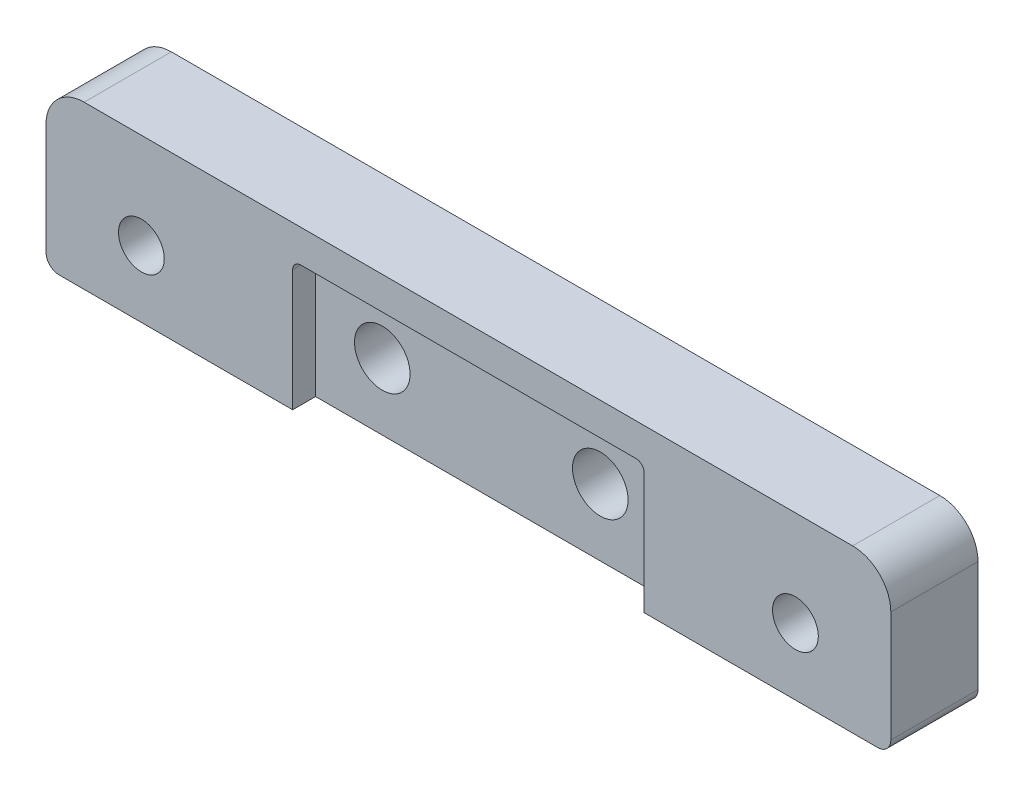
ISO-10303-21;
HEADER;
FILE_DESCRIPTION(('STEP AP214'),'2;1');
FILE_NAME('part.step','',(''),(''),'','','');
FILE_SCHEMA(('AUTOMOTIVE_DESIGN { 1 0 10303 214 1 1 1 1 }'));
ENDSEC;
DATA;
#1=APPLICATION_CONTEXT('core data for automotive mechanical design processes');
#2=APPLICATION_PROTOCOL_DEFINITION('international standard','automotive_design',2000,#1);
#3=PRODUCT_CONTEXT('',#1,'mechanical');
#4=PRODUCT('Part','Part','',(#3));
#5=PRODUCT_RELATED_PRODUCT_CATEGORY('part','',(#4));
#6=PRODUCT_DEFINITION_FORMATION('','',#4);
#7=PRODUCT_DEFINITION_CONTEXT('part definition',#1,'design');
#8=PRODUCT_DEFINITION('design','',#6,#7);
#9=PRODUCT_DEFINITION_SHAPE('','',#8);
#10=(LENGTH_UNIT() NAMED_UNIT(*) SI_UNIT(.MILLI.,.METRE.));
#11=(NAMED_UNIT(*) PLANE_ANGLE_UNIT() SI_UNIT($,.RADIAN.));
#12=(NAMED_UNIT(*) SI_UNIT($,.STERADIAN.) SOLID_ANGLE_UNIT());
#13=UNCERTAINTY_MEASURE_WITH_UNIT(LENGTH_MEASURE(1.E-05),#10,'distance_accuracy_value','');
#14=(GEOMETRIC_REPRESENTATION_CONTEXT(3) GLOBAL_UNCERTAINTY_ASSIGNED_CONTEXT((#13)) GLOBAL_UNIT_ASSIGNED_CONTEXT((#10,
#11,#12)) REPRESENTATION_CONTEXT('',''));
#15=CARTESIAN_POINT('',(0.,0.,0.));
#16=DIRECTION('',(0.,0.,1.));
#17=DIRECTION('',(1.,0.,0.));
#18=AXIS2_PLACEMENT_3D('',#15,#16,#17);
#19=CARTESIAN_POINT('',(-38.75,-7.437,8.));
#20=DIRECTION('',(1.,0.,0.));
#21=DIRECTION('',(0.,0.,-1.));
#22=AXIS2_PLACEMENT_3D('',#19,#20,#21);
#23=PLANE('',#22);
#24=DIRECTION('',(0.,-1.,0.));
#25=VECTOR('',#24,1.);
#26=CARTESIAN_POINT('',(-38.75,-7.437,0.));
#27=LINE('',#26,#25);
#28=CARTESIAN_POINT('',(-38.75,3.937,0.));
#29=VERTEX_POINT('',#28);
#30=CARTESIAN_POINT('',(-38.75,-6.237,0.));
#31=VERTEX_POINT('',#30);
#32=EDGE_CURVE('E179',#29,#31,#27,.T.);
#33=ORIENTED_EDGE('',*,*,#32,.T.);
#34=DIRECTION('',(0.,0.,-1.));
#35=VECTOR('',#34,1.);
#36=CARTESIAN_POINT('',(-38.75,-6.237,8.));
#37=LINE('',#36,#35);
#38=CARTESIAN_POINT('',(-38.75,-6.237,8.));
#39=VERTEX_POINT('',#38);
#40=EDGE_CURVE('E57',#31,#39,#37,.F.);
#41=ORIENTED_EDGE('',*,*,#40,.T.);
#42=DIRECTION('',(0.,-1.,0.));
#43=VECTOR('',#42,1.);
#44=CARTESIAN_POINT('',(-38.75,-7.437,8.));
#45=LINE('',#44,#43);
#46=CARTESIAN_POINT('',(-38.75,3.937,8.));
#47=VERTEX_POINT('',#46);
#48=EDGE_CURVE('E181',#47,#39,#45,.T.);
#49=ORIENTED_EDGE('',*,*,#48,.F.);
#50=DIRECTION('',(0.,0.,-1.));
#51=VECTOR('',#50,1.);
#52=CARTESIAN_POINT('',(-38.75,3.937,8.));
#53=LINE('',#52,#51);
#54=EDGE_CURVE('E217',#47,#29,#53,.T.);
#55=ORIENTED_EDGE('',*,*,#54,.T.);
#56=EDGE_LOOP('',(#33,#41,#49,#55));
#57=FACE_BOUND('',#56,.T.);
#58=ADVANCED_FACE('F34',(#57),#23,.F.);
#59=CARTESIAN_POINT('',(38.75,-7.437,8.));
#60=DIRECTION('',(0.,1.,0.));
#61=DIRECTION('',(-1.,0.,0.));
#62=AXIS2_PLACEMENT_3D('',#59,#60,#61);
#63=PLANE('',#62);
#64=DIRECTION('',(1.,0.,0.));
#65=VECTOR('',#64,1.);
#66=CARTESIAN_POINT('',(38.75,-7.437,8.));
#67=LINE('',#66,#65);
#68=CARTESIAN_POINT('',(-37.55,-7.437,8.));
#69=VERTEX_POINT('',#68);
#70=CARTESIAN_POINT('',(-16.12,-7.437,8.));
#71=VERTEX_POINT('',#70);
#72=EDGE_CURVE('E185',#69,#71,#67,.T.);
#73=ORIENTED_EDGE('',*,*,#72,.F.);
#74=DIRECTION('',(0.,0.,-1.));
#75=VECTOR('',#74,1.);
#76=CARTESIAN_POINT('',(-37.55,-7.437,8.));
#77=LINE('',#76,#75);
#78=CARTESIAN_POINT('',(-37.55,-7.437,0.));
#79=VERTEX_POINT('',#78);
#80=EDGE_CURVE('E238',#69,#79,#77,.T.);
#81=ORIENTED_EDGE('',*,*,#80,.T.);
#82=DIRECTION('',(1.,0.,0.));
#83=VECTOR('',#82,1.);
#84=CARTESIAN_POINT('',(38.75,-7.437,0.));
#85=LINE('',#84,#83);
#86=CARTESIAN_POINT('',(37.55,-7.437,0.));
#87=VERTEX_POINT('',#86);
#88=EDGE_CURVE('E194',#79,#87,#85,.T.);
#89=ORIENTED_EDGE('',*,*,#88,.T.);
#90=DIRECTION('',(0.,0.,-1.));
#91=VECTOR('',#90,1.);
#92=CARTESIAN_POINT('',(37.55,-7.437,8.));
#93=LINE('',#92,#91);
#94=CARTESIAN_POINT('',(37.55,-7.437,8.));
#95=VERTEX_POINT('',#94);
#96=EDGE_CURVE('E236',#87,#95,#93,.F.);
#97=ORIENTED_EDGE('',*,*,#96,.T.);
#98=CARTESIAN_POINT('',(16.12,-7.437,8.));
#99=VERTEX_POINT('',#98);
#100=EDGE_CURVE('E183',#99,#95,#67,.T.);
#101=ORIENTED_EDGE('',*,*,#100,.F.);
#102=DIRECTION('',(0.,0.,1.));
#103=VECTOR('',#102,1.);
#104=CARTESIAN_POINT('',(16.12,-7.437,5.9));
#105=LINE('',#104,#103);
#106=CARTESIAN_POINT('',(16.12,-7.437,5.9));
#107=VERTEX_POINT('',#106);
#108=EDGE_CURVE('E161',#107,#99,#105,.T.);
#109=ORIENTED_EDGE('',*,*,#108,.F.);
#110=DIRECTION('',(1.,0.,0.));
#111=VECTOR('',#110,1.);
#112=CARTESIAN_POINT('',(-16.12,-7.437,5.9));
#113=LINE('',#112,#111);
#114=CARTESIAN_POINT('',(-16.12,-7.437,5.9));
#115=VERTEX_POINT('',#114);
#116=EDGE_CURVE('E143',#115,#107,#113,.T.);
#117=ORIENTED_EDGE('',*,*,#116,.F.);
#118=DIRECTION('',(0.,0.,1.));
#119=VECTOR('',#118,1.);
#120=CARTESIAN_POINT('',(-16.12,-7.437,5.9));
#121=LINE('',#120,#119);
#122=EDGE_CURVE('E155',#115,#71,#121,.T.);
#123=ORIENTED_EDGE('',*,*,#122,.T.);
#124=EDGE_LOOP('',(#73,#81,#89,#97,#101,#109,#117,#123));
#125=FACE_BOUND('',#124,.T.);
#126=ADVANCED_FACE('F164',(#125),#63,.F.);
#127=CARTESIAN_POINT('',(38.75,-7.437,8.));
#128=DIRECTION('',(-1.,0.,0.));
#129=DIRECTION('',(0.,0.,1.));
#130=AXIS2_PLACEMENT_3D('',#127,#128,#129);
#131=PLANE('',#130);
#132=DIRECTION('',(0.,1.,0.));
#133=VECTOR('',#132,1.);
#134=CARTESIAN_POINT('',(38.75,-7.437,8.));
#135=LINE('',#134,#133);
#136=CARTESIAN_POINT('',(38.75,-6.237,8.));
#137=VERTEX_POINT('',#136);
#138=CARTESIAN_POINT('',(38.75,3.937,8.));
#139=VERTEX_POINT('',#138);
#140=EDGE_CURVE('E187',#137,#139,#135,.T.);
#141=ORIENTED_EDGE('',*,*,#140,.F.);
#142=DIRECTION('',(0.,0.,-1.));
#143=VECTOR('',#142,1.);
#144=CARTESIAN_POINT('',(38.75,-6.237,8.));
#145=LINE('',#144,#143);
#146=CARTESIAN_POINT('',(38.75,-6.237,0.));
#147=VERTEX_POINT('',#146);
#148=EDGE_CURVE('E11',#137,#147,#145,.T.);
#149=ORIENTED_EDGE('',*,*,#148,.T.);
#150=DIRECTION('',(0.,1.,0.));
#151=VECTOR('',#150,1.);
#152=CARTESIAN_POINT('',(38.75,-7.437,0.));
#153=LINE('',#152,#151);
#154=CARTESIAN_POINT('',(38.75,3.937,0.));
#155=VERTEX_POINT('',#154);
#156=EDGE_CURVE('E197',#147,#155,#153,.T.);
#157=ORIENTED_EDGE('',*,*,#156,.T.);
#158=DIRECTION('',(0.,0.,-1.));
#159=VECTOR('',#158,1.);
#160=CARTESIAN_POINT('',(38.75,3.937,8.));
#161=LINE('',#160,#159);
#162=EDGE_CURVE('E210',#155,#139,#161,.F.);
#163=ORIENTED_EDGE('',*,*,#162,.T.);
#164=EDGE_LOOP('',(#141,#149,#157,#163));
#165=FACE_BOUND('',#164,.T.);
#166=ADVANCED_FACE('F271',(#165),#131,.F.);
#167=CARTESIAN_POINT('',(38.75,7.437,8.));
#168=DIRECTION('',(0.,-1.,0.));
#169=DIRECTION('',(1.,0.,0.));
#170=AXIS2_PLACEMENT_3D('',#167,#168,#169);
#171=PLANE('',#170);
#172=DIRECTION('',(-1.,0.,0.));
#173=VECTOR('',#172,1.);
#174=CARTESIAN_POINT('',(38.75,7.437,8.));
#175=LINE('',#174,#173);
#176=CARTESIAN_POINT('',(35.25,7.437,8.));
#177=VERTEX_POINT('',#176);
#178=CARTESIAN_POINT('',(-35.25,7.437,8.));
#179=VERTEX_POINT('',#178);
#180=EDGE_CURVE('E189',#177,#179,#175,.T.);
#181=ORIENTED_EDGE('',*,*,#180,.F.);
#182=DIRECTION('',(0.,0.,-1.));
#183=VECTOR('',#182,1.);
#184=CARTESIAN_POINT('',(35.25,7.437,8.));
#185=LINE('',#184,#183);
#186=CARTESIAN_POINT('',(35.25,7.437,0.));
#187=VERTEX_POINT('',#186);
#188=EDGE_CURVE('E202',#177,#187,#185,.T.);
#189=ORIENTED_EDGE('',*,*,#188,.T.);
#190=DIRECTION('',(-1.,0.,0.));
#191=VECTOR('',#190,1.);
#192=CARTESIAN_POINT('',(38.75,7.437,0.));
#193=LINE('',#192,#191);
#194=CARTESIAN_POINT('',(-35.25,7.437,0.));
#195=VERTEX_POINT('',#194);
#196=EDGE_CURVE('E184',#187,#195,#193,.T.);
#197=ORIENTED_EDGE('',*,*,#196,.T.);
#198=DIRECTION('',(0.,0.,-1.));
#199=VECTOR('',#198,1.);
#200=CARTESIAN_POINT('',(-35.25,7.437,8.));
#201=LINE('',#200,#199);
#202=EDGE_CURVE('E192',#195,#179,#201,.F.);
#203=ORIENTED_EDGE('',*,*,#202,.T.);
#204=EDGE_LOOP('',(#181,#189,#197,#203));
#205=FACE_BOUND('',#204,.T.);
#206=ADVANCED_FACE('F263',(#205),#171,.F.);
#207=CARTESIAN_POINT('',(0.,0.,8.));
#208=DIRECTION('',(0.,0.,1.));
#209=DIRECTION('',(1.,0.,0.));
#210=AXIS2_PLACEMENT_3D('',#207,#208,#209);
#211=PLANE('',#210);
#212=CARTESIAN_POINT('',(-30.,-1.323,8.));
#213=DIRECTION('',(0.,0.,1.));
#214=DIRECTION('',(1.,0.,0.));
#215=AXIS2_PLACEMENT_3D('',#212,#213,#214);
#216=CIRCLE('',#215,2.09999999999999);
#217=CARTESIAN_POINT('',(-27.9,-1.323,8.));
#218=VERTEX_POINT('',#217);
#219=EDGE_CURVE('E486',#218,#218,#216,.T.);
#220=ORIENTED_EDGE('',*,*,#219,.F.);
#221=EDGE_LOOP('',(#220));
#222=FACE_BOUND('',#221,.T.);
#223=CARTESIAN_POINT('',(30.,-1.323,8.));
#224=DIRECTION('',(0.,0.,1.));
#225=DIRECTION('',(1.,0.,0.));
#226=AXIS2_PLACEMENT_3D('',#223,#224,#225);
#227=CIRCLE('',#226,2.09999999999999);
#228=CARTESIAN_POINT('',(32.1,-1.323,8.));
#229=VERTEX_POINT('',#228);
#230=EDGE_CURVE('E482',#229,#229,#227,.T.);
#231=ORIENTED_EDGE('',*,*,#230,.F.);
#232=EDGE_LOOP('',(#231));
#233=FACE_BOUND('',#232,.T.);
#234=ORIENTED_EDGE('',*,*,#48,.T.);
#235=CARTESIAN_POINT('',(-37.55,-6.237,8.));
#236=DIRECTION('',(0.,0.,1.));
#237=DIRECTION('',(1.,0.,0.));
#238=AXIS2_PLACEMENT_3D('',#235,#236,#237);
#239=CIRCLE('',#238,1.2);
#240=EDGE_CURVE('E42',#39,#69,#239,.T.);
#241=ORIENTED_EDGE('',*,*,#240,.T.);
#242=ORIENTED_EDGE('',*,*,#72,.T.);
#243=DIRECTION('',(0.,-1.,0.));
#244=VECTOR('',#243,1.);
#245=CARTESIAN_POINT('',(-16.12,-7.437,8.));
#246=LINE('',#245,#244);
#247=CARTESIAN_POINT('',(-16.12,3.69,8.));
#248=VERTEX_POINT('',#247);
#249=EDGE_CURVE('E158',#248,#71,#246,.T.);
#250=ORIENTED_EDGE('',*,*,#249,.F.);
#251=CARTESIAN_POINT('',(-15.37,3.69,8.));
#252=DIRECTION('',(0.,0.,1.));
#253=DIRECTION('',(1.,0.,0.));
#254=AXIS2_PLACEMENT_3D('',#251,#252,#253);
#255=CIRCLE('',#254,0.75);
#256=CARTESIAN_POINT('',(-15.37,4.44,8.));
#257=VERTEX_POINT('',#256);
#258=EDGE_CURVE('E234',#248,#257,#255,.F.);
#259=ORIENTED_EDGE('',*,*,#258,.T.);
#260=DIRECTION('',(-1.,0.,0.));
#261=VECTOR('',#260,1.);
#262=CARTESIAN_POINT('',(-16.12,4.44,8.));
#263=LINE('',#262,#261);
#264=CARTESIAN_POINT('',(15.37,4.44,8.));
#265=VERTEX_POINT('',#264);
#266=EDGE_CURVE('E151',#265,#257,#263,.T.);
#267=ORIENTED_EDGE('',*,*,#266,.F.);
#268=CARTESIAN_POINT('',(15.37,3.69,8.));
#269=DIRECTION('',(0.,0.,1.));
#270=DIRECTION('',(1.,0.,0.));
#271=AXIS2_PLACEMENT_3D('',#268,#269,#270);
#272=CIRCLE('',#271,0.75);
#273=CARTESIAN_POINT('',(16.12,3.69,8.));
#274=VERTEX_POINT('',#273);
#275=EDGE_CURVE('E232',#265,#274,#272,.F.);
#276=ORIENTED_EDGE('',*,*,#275,.T.);
#277=DIRECTION('',(0.,1.,0.));
#278=VECTOR('',#277,1.);
#279=CARTESIAN_POINT('',(16.12,-7.437,8.));
#280=LINE('',#279,#278);
#281=EDGE_CURVE('E173',#99,#274,#280,.T.);
#282=ORIENTED_EDGE('',*,*,#281,.F.);
#283=ORIENTED_EDGE('',*,*,#100,.T.);
#284=CARTESIAN_POINT('',(37.55,-6.237,8.));
#285=DIRECTION('',(0.,0.,1.));
#286=DIRECTION('',(1.,0.,0.));
#287=AXIS2_PLACEMENT_3D('',#284,#285,#286);
#288=CIRCLE('',#287,1.2);
#289=EDGE_CURVE('E49',#95,#137,#288,.T.);
#290=ORIENTED_EDGE('',*,*,#289,.T.);
#291=ORIENTED_EDGE('',*,*,#140,.T.);
#292=CARTESIAN_POINT('',(35.25,3.937,8.));
#293=DIRECTION('',(0.,0.,1.));
#294=DIRECTION('',(1.,0.,0.));
#295=AXIS2_PLACEMENT_3D('',#292,#293,#294);
#296=CIRCLE('',#295,3.5);
#297=EDGE_CURVE('E215',#139,#177,#296,.T.);
#298=ORIENTED_EDGE('',*,*,#297,.T.);
#299=ORIENTED_EDGE('',*,*,#180,.T.);
#300=CARTESIAN_POINT('',(-35.25,3.937,8.));
#301=DIRECTION('',(0.,0.,1.));
#302=DIRECTION('',(1.,0.,0.));
#303=AXIS2_PLACEMENT_3D('',#300,#301,#302);
#304=CIRCLE('',#303,3.5);
#305=EDGE_CURVE('E213',#179,#47,#304,.T.);
#306=ORIENTED_EDGE('',*,*,#305,.T.);
#307=EDGE_LOOP('',(#234,#241,#242,#250,#259,#267,#276,#282,#283,#290,#291,#298,#299,#306));
#308=FACE_BOUND('',#307,.T.);
#309=ADVANCED_FACE('F247',(#222,#233,#308),#211,.T.);
#310=CARTESIAN_POINT('',(0.,0.,0.));
#311=DIRECTION('',(0.,0.,1.));
#312=DIRECTION('',(1.,0.,0.));
#313=AXIS2_PLACEMENT_3D('',#310,#311,#312);
#314=PLANE('',#313);
#315=CARTESIAN_POINT('',(-30.,-1.323,0.));
#316=DIRECTION('',(0.,0.,1.));
#317=DIRECTION('',(1.,0.,0.));
#318=AXIS2_PLACEMENT_3D('',#315,#316,#317);
#319=CIRCLE('',#318,2.1);
#320=CARTESIAN_POINT('',(-27.9,-1.323,0.));
#321=VERTEX_POINT('',#320);
#322=EDGE_CURVE('E462',#321,#321,#319,.T.);
#323=ORIENTED_EDGE('',*,*,#322,.T.);
#324=EDGE_LOOP('',(#323));
#325=FACE_BOUND('',#324,.T.);
#326=CARTESIAN_POINT('',(30.,-1.323,0.));
#327=DIRECTION('',(0.,0.,1.));
#328=DIRECTION('',(1.,0.,0.));
#329=AXIS2_PLACEMENT_3D('',#326,#327,#328);
#330=CIRCLE('',#329,2.1);
#331=CARTESIAN_POINT('',(32.1,-1.323,0.));
#332=VERTEX_POINT('',#331);
#333=EDGE_CURVE('E466',#332,#332,#330,.T.);
#334=ORIENTED_EDGE('',*,*,#333,.T.);
#335=EDGE_LOOP('',(#334));
#336=FACE_BOUND('',#335,.T.);
#337=CARTESIAN_POINT('',(10.,-1.32299999999999,0.));
#338=DIRECTION('',(0.,0.,1.));
#339=DIRECTION('',(-1.,0.,0.));
#340=AXIS2_PLACEMENT_3D('',#337,#338,#339);
#341=CIRCLE('',#340,2.55);
#342=CARTESIAN_POINT('',(7.45,-1.32299999999999,0.));
#343=VERTEX_POINT('',#342);
#344=EDGE_CURVE('E470',#343,#343,#341,.T.);
#345=ORIENTED_EDGE('',*,*,#344,.T.);
#346=EDGE_LOOP('',(#345));
#347=FACE_BOUND('',#346,.T.);
#348=CARTESIAN_POINT('',(-10.,-1.323,0.));
#349=DIRECTION('',(0.,0.,1.));
#350=DIRECTION('',(1.,0.,0.));
#351=AXIS2_PLACEMENT_3D('',#348,#349,#350);
#352=CIRCLE('',#351,2.55);
#353=CARTESIAN_POINT('',(-7.45,-1.323,0.));
#354=VERTEX_POINT('',#353);
#355=EDGE_CURVE('E174',#354,#354,#352,.T.);
#356=ORIENTED_EDGE('',*,*,#355,.T.);
#357=EDGE_LOOP('',(#356));
#358=FACE_BOUND('',#357,.T.);
#359=ORIENTED_EDGE('',*,*,#88,.F.);
#360=CARTESIAN_POINT('',(-37.55,-6.237,0.));
#361=DIRECTION('',(0.,0.,1.));
#362=DIRECTION('',(1.,0.,0.));
#363=AXIS2_PLACEMENT_3D('',#360,#361,#362);
#364=CIRCLE('',#363,1.2);
#365=EDGE_CURVE('E243',#79,#31,#364,.F.);
#366=ORIENTED_EDGE('',*,*,#365,.T.);
#367=ORIENTED_EDGE('',*,*,#32,.F.);
#368=CARTESIAN_POINT('',(-35.25,3.937,0.));
#369=DIRECTION('',(0.,0.,1.));
#370=DIRECTION('',(1.,0.,0.));
#371=AXIS2_PLACEMENT_3D('',#368,#369,#370);
#372=CIRCLE('',#371,3.5);
#373=EDGE_CURVE('E205',#29,#195,#372,.F.);
#374=ORIENTED_EDGE('',*,*,#373,.T.);
#375=ORIENTED_EDGE('',*,*,#196,.F.);
#376=CARTESIAN_POINT('',(35.25,3.937,0.));
#377=DIRECTION('',(0.,0.,1.));
#378=DIRECTION('',(1.,0.,0.));
#379=AXIS2_PLACEMENT_3D('',#376,#377,#378);
#380=CIRCLE('',#379,3.5);
#381=EDGE_CURVE('E207',#187,#155,#380,.F.);
#382=ORIENTED_EDGE('',*,*,#381,.T.);
#383=ORIENTED_EDGE('',*,*,#156,.F.);
#384=CARTESIAN_POINT('',(37.55,-6.237,0.));
#385=DIRECTION('',(0.,0.,1.));
#386=DIRECTION('',(1.,0.,0.));
#387=AXIS2_PLACEMENT_3D('',#384,#385,#386);
#388=CIRCLE('',#387,1.2);
#389=EDGE_CURVE('E241',#147,#87,#388,.F.);
#390=ORIENTED_EDGE('',*,*,#389,.T.);
#391=EDGE_LOOP('',(#359,#366,#367,#374,#375,#382,#383,#390));
#392=FACE_BOUND('',#391,.T.);
#393=ADVANCED_FACE('F254',(#325,#336,#347,#358,#392),#314,.F.);
#394=CARTESIAN_POINT('',(-16.12,-7.437,5.9));
#395=DIRECTION('',(-1.,0.,0.));
#396=DIRECTION('',(0.,0.,1.));
#397=AXIS2_PLACEMENT_3D('',#394,#395,#396);
#398=PLANE('',#397);
#399=DIRECTION('',(0.,-1.,0.));
#400=VECTOR('',#399,1.);
#401=CARTESIAN_POINT('',(-16.12,-7.437,5.9));
#402=LINE('',#401,#400);
#403=CARTESIAN_POINT('',(-16.12,3.69,5.9));
#404=VERTEX_POINT('',#403);
#405=EDGE_CURVE('E138',#404,#115,#402,.T.);
#406=ORIENTED_EDGE('',*,*,#405,.F.);
#407=DIRECTION('',(0.,0.,1.));
#408=VECTOR('',#407,1.);
#409=CARTESIAN_POINT('',(-16.12,3.69,8.));
#410=LINE('',#409,#408);
#411=EDGE_CURVE('E230',#404,#248,#410,.T.);
#412=ORIENTED_EDGE('',*,*,#411,.T.);
#413=ORIENTED_EDGE('',*,*,#249,.T.);
#414=ORIENTED_EDGE('',*,*,#122,.F.);
#415=EDGE_LOOP('',(#406,#412,#413,#414));
#416=FACE_BOUND('',#415,.T.);
#417=ADVANCED_FACE('F156',(#416),#398,.F.);
#418=CARTESIAN_POINT('',(-16.12,4.44,5.9));
#419=DIRECTION('',(0.,1.,0.));
#420=DIRECTION('',(0.,0.,1.));
#421=AXIS2_PLACEMENT_3D('',#418,#419,#420);
#422=PLANE('',#421);
#423=DIRECTION('',(-1.,0.,0.));
#424=VECTOR('',#423,1.);
#425=CARTESIAN_POINT('',(-16.12,4.44,5.9));
#426=LINE('',#425,#424);
#427=CARTESIAN_POINT('',(15.37,4.44,5.9));
#428=VERTEX_POINT('',#427);
#429=CARTESIAN_POINT('',(-15.37,4.44,5.9));
#430=VERTEX_POINT('',#429);
#431=EDGE_CURVE('E162',#428,#430,#426,.T.);
#432=ORIENTED_EDGE('',*,*,#431,.F.);
#433=DIRECTION('',(0.,0.,1.));
#434=VECTOR('',#433,1.);
#435=CARTESIAN_POINT('',(15.37,4.44,8.));
#436=LINE('',#435,#434);
#437=EDGE_CURVE('E222',#428,#265,#436,.T.);
#438=ORIENTED_EDGE('',*,*,#437,.T.);
#439=ORIENTED_EDGE('',*,*,#266,.T.);
#440=DIRECTION('',(0.,0.,1.));
#441=VECTOR('',#440,1.);
#442=CARTESIAN_POINT('',(-15.37,4.44,5.9));
#443=LINE('',#442,#441);
#444=EDGE_CURVE('E220',#257,#430,#443,.F.);
#445=ORIENTED_EDGE('',*,*,#444,.T.);
#446=EDGE_LOOP('',(#432,#438,#439,#445));
#447=FACE_BOUND('',#446,.T.);
#448=ADVANCED_FACE('F286',(#447),#422,.F.);
#449=CARTESIAN_POINT('',(16.12,-7.437,5.9));
#450=DIRECTION('',(1.,0.,0.));
#451=DIRECTION('',(0.,0.,-1.));
#452=AXIS2_PLACEMENT_3D('',#449,#450,#451);
#453=PLANE('',#452);
#454=ORIENTED_EDGE('',*,*,#281,.T.);
#455=DIRECTION('',(0.,0.,1.));
#456=VECTOR('',#455,1.);
#457=CARTESIAN_POINT('',(16.12,3.69,5.9));
#458=LINE('',#457,#456);
#459=CARTESIAN_POINT('',(16.12,3.69,5.9));
#460=VERTEX_POINT('',#459);
#461=EDGE_CURVE('E225',#274,#460,#458,.F.);
#462=ORIENTED_EDGE('',*,*,#461,.T.);
#463=DIRECTION('',(0.,1.,0.));
#464=VECTOR('',#463,1.);
#465=CARTESIAN_POINT('',(16.12,-7.437,5.9));
#466=LINE('',#465,#464);
#467=EDGE_CURVE('E166',#107,#460,#466,.T.);
#468=ORIENTED_EDGE('',*,*,#467,.F.);
#469=ORIENTED_EDGE('',*,*,#108,.T.);
#470=EDGE_LOOP('',(#454,#462,#468,#469));
#471=FACE_BOUND('',#470,.T.);
#472=ADVANCED_FACE('F279',(#471),#453,.F.);
#473=CARTESIAN_POINT('',(0.,0.,5.9));
#474=DIRECTION('',(0.,0.,-1.));
#475=DIRECTION('',(-1.,0.,0.));
#476=AXIS2_PLACEMENT_3D('',#473,#474,#475);
#477=PLANE('',#476);
#478=CARTESIAN_POINT('',(10.,-1.32299999999999,5.9));
#479=DIRECTION('',(0.,0.,1.));
#480=DIRECTION('',(-1.,0.,0.));
#481=AXIS2_PLACEMENT_3D('',#478,#479,#480);
#482=CIRCLE('',#481,2.55);
#483=CARTESIAN_POINT('',(7.45,-1.32299999999999,5.9));
#484=VERTEX_POINT('',#483);
#485=EDGE_CURVE('E477',#484,#484,#482,.T.);
#486=ORIENTED_EDGE('',*,*,#485,.F.);
#487=EDGE_LOOP('',(#486));
#488=FACE_BOUND('',#487,.T.);
#489=CARTESIAN_POINT('',(-10.,-1.323,5.9));
#490=DIRECTION('',(0.,0.,1.));
#491=DIRECTION('',(1.,0.,0.));
#492=AXIS2_PLACEMENT_3D('',#489,#490,#491);
#493=CIRCLE('',#492,2.55);
#494=CARTESIAN_POINT('',(-7.45,-1.323,5.9));
#495=VERTEX_POINT('',#494);
#496=EDGE_CURVE('E473',#495,#495,#493,.T.);
#497=ORIENTED_EDGE('',*,*,#496,.F.);
#498=EDGE_LOOP('',(#497));
#499=FACE_BOUND('',#498,.T.);
#500=ORIENTED_EDGE('',*,*,#467,.T.);
#501=CARTESIAN_POINT('',(15.37,3.69,5.9));
#502=DIRECTION('',(0.,0.,-1.));
#503=DIRECTION('',(-1.,0.,0.));
#504=AXIS2_PLACEMENT_3D('',#501,#502,#503);
#505=CIRCLE('',#504,0.75);
#506=EDGE_CURVE('E228',#460,#428,#505,.F.);
#507=ORIENTED_EDGE('',*,*,#506,.T.);
#508=ORIENTED_EDGE('',*,*,#431,.T.);
#509=CARTESIAN_POINT('',(-15.37,3.69,5.9));
#510=DIRECTION('',(0.,0.,-1.));
#511=DIRECTION('',(-1.,0.,0.));
#512=AXIS2_PLACEMENT_3D('',#509,#510,#511);
#513=CIRCLE('',#512,0.75);
#514=EDGE_CURVE('E147',#430,#404,#513,.F.);
#515=ORIENTED_EDGE('',*,*,#514,.T.);
#516=ORIENTED_EDGE('',*,*,#405,.T.);
#517=ORIENTED_EDGE('',*,*,#116,.T.);
#518=EDGE_LOOP('',(#500,#507,#508,#515,#516,#517));
#519=FACE_BOUND('',#518,.T.);
#520=ADVANCED_FACE('F141',(#488,#499,#519),#477,.F.);
#521=CARTESIAN_POINT('',(35.25,3.937,8.));
#522=DIRECTION('',(0.,0.,-1.));
#523=DIRECTION('',(-1.,0.,0.));
#524=AXIS2_PLACEMENT_3D('',#521,#522,#523);
#525=CYLINDRICAL_SURFACE('',#524,3.5);
#526=ORIENTED_EDGE('',*,*,#297,.F.);
#527=ORIENTED_EDGE('',*,*,#162,.F.);
#528=ORIENTED_EDGE('',*,*,#381,.F.);
#529=ORIENTED_EDGE('',*,*,#188,.F.);
#530=EDGE_LOOP('',(#526,#527,#528,#529));
#531=FACE_BOUND('',#530,.T.);
#532=ADVANCED_FACE('F267',(#531),#525,.T.);
#533=CARTESIAN_POINT('',(-35.25,3.937,8.));
#534=DIRECTION('',(0.,0.,-1.));
#535=DIRECTION('',(-1.,0.,0.));
#536=AXIS2_PLACEMENT_3D('',#533,#534,#535);
#537=CYLINDRICAL_SURFACE('',#536,3.5);
#538=ORIENTED_EDGE('',*,*,#305,.F.);
#539=ORIENTED_EDGE('',*,*,#202,.F.);
#540=ORIENTED_EDGE('',*,*,#373,.F.);
#541=ORIENTED_EDGE('',*,*,#54,.F.);
#542=EDGE_LOOP('',(#538,#539,#540,#541));
#543=FACE_BOUND('',#542,.T.);
#544=ADVANCED_FACE('F258',(#543),#537,.T.);
#545=CARTESIAN_POINT('',(15.37,3.69,5.9));
#546=DIRECTION('',(0.,0.,-1.));
#547=DIRECTION('',(-1.,0.,0.));
#548=AXIS2_PLACEMENT_3D('',#545,#546,#547);
#549=CYLINDRICAL_SURFACE('',#548,0.75);
#550=ORIENTED_EDGE('',*,*,#506,.F.);
#551=ORIENTED_EDGE('',*,*,#461,.F.);
#552=ORIENTED_EDGE('',*,*,#275,.F.);
#553=ORIENTED_EDGE('',*,*,#437,.F.);
#554=EDGE_LOOP('',(#550,#551,#552,#553));
#555=FACE_BOUND('',#554,.T.);
#556=ADVANCED_FACE('F282',(#555),#549,.F.);
#557=CARTESIAN_POINT('',(-15.37,3.69,5.9));
#558=DIRECTION('',(0.,0.,-1.));
#559=DIRECTION('',(-1.,0.,0.));
#560=AXIS2_PLACEMENT_3D('',#557,#558,#559);
#561=CYLINDRICAL_SURFACE('',#560,0.75);
#562=ORIENTED_EDGE('',*,*,#514,.F.);
#563=ORIENTED_EDGE('',*,*,#444,.F.);
#564=ORIENTED_EDGE('',*,*,#258,.F.);
#565=ORIENTED_EDGE('',*,*,#411,.F.);
#566=EDGE_LOOP('',(#562,#563,#564,#565));
#567=FACE_BOUND('',#566,.T.);
#568=ADVANCED_FACE('F289',(#567),#561,.F.);
#569=CARTESIAN_POINT('',(-10.,-1.323,0.));
#570=DIRECTION('',(0.,0.,1.));
#571=DIRECTION('',(1.,0.,0.));
#572=AXIS2_PLACEMENT_3D('',#569,#570,#571);
#573=CYLINDRICAL_SURFACE('',#572,2.55);
#574=ORIENTED_EDGE('',*,*,#355,.F.);
#575=EDGE_LOOP('',(#574));
#576=FACE_BOUND('',#575,.T.);
#577=ORIENTED_EDGE('',*,*,#496,.T.);
#578=EDGE_LOOP('',(#577));
#579=FACE_BOUND('',#578,.T.);
#580=ADVANCED_FACE('F291',(#576,#579),#573,.F.);
#581=CARTESIAN_POINT('',(10.,-1.32299999999999,0.));
#582=DIRECTION('',(0.,0.,1.));
#583=DIRECTION('',(1.,0.,0.));
#584=AXIS2_PLACEMENT_3D('',#581,#582,#583);
#585=CYLINDRICAL_SURFACE('',#584,2.55);
#586=ORIENTED_EDGE('',*,*,#344,.F.);
#587=EDGE_LOOP('',(#586));
#588=FACE_BOUND('',#587,.T.);
#589=ORIENTED_EDGE('',*,*,#485,.T.);
#590=EDGE_LOOP('',(#589));
#591=FACE_BOUND('',#590,.T.);
#592=ADVANCED_FACE('F297',(#588,#591),#585,.F.);
#593=CARTESIAN_POINT('',(30.,-1.323,8.));
#594=DIRECTION('',(0.,0.,1.));
#595=DIRECTION('',(1.,0.,0.));
#596=AXIS2_PLACEMENT_3D('',#593,#594,#595);
#597=CYLINDRICAL_SURFACE('',#596,2.09999999999999);
#598=ORIENTED_EDGE('',*,*,#333,.F.);
#599=EDGE_LOOP('',(#598));
#600=FACE_BOUND('',#599,.T.);
#601=ORIENTED_EDGE('',*,*,#230,.T.);
#602=EDGE_LOOP('',(#601));
#603=FACE_BOUND('',#602,.T.);
#604=ADVANCED_FACE('F355',(#600,#603),#597,.F.);
#605=CARTESIAN_POINT('',(-30.,-1.323,8.));
#606=DIRECTION('',(0.,0.,1.));
#607=DIRECTION('',(1.,0.,0.));
#608=AXIS2_PLACEMENT_3D('',#605,#606,#607);
#609=CYLINDRICAL_SURFACE('',#608,2.09999999999999);
#610=ORIENTED_EDGE('',*,*,#322,.F.);
#611=EDGE_LOOP('',(#610));
#612=FACE_BOUND('',#611,.T.);
#613=ORIENTED_EDGE('',*,*,#219,.T.);
#614=EDGE_LOOP('',(#613));
#615=FACE_BOUND('',#614,.T.);
#616=ADVANCED_FACE('F365',(#612,#615),#609,.F.);
#617=CARTESIAN_POINT('',(-37.55,-6.237,8.));
#618=DIRECTION('',(0.,0.,-1.));
#619=DIRECTION('',(-1.,0.,0.));
#620=AXIS2_PLACEMENT_3D('',#617,#618,#619);
#621=CYLINDRICAL_SURFACE('',#620,1.2);
#622=ORIENTED_EDGE('',*,*,#240,.F.);
#623=ORIENTED_EDGE('',*,*,#40,.F.);
#624=ORIENTED_EDGE('',*,*,#365,.F.);
#625=ORIENTED_EDGE('',*,*,#80,.F.);
#626=EDGE_LOOP('',(#622,#623,#624,#625));
#627=FACE_BOUND('',#626,.T.);
#628=ADVANCED_FACE('F251',(#627),#621,.T.);
#629=CARTESIAN_POINT('',(37.55,-6.237,8.));
#630=DIRECTION('',(0.,0.,-1.));
#631=DIRECTION('',(-1.,0.,0.));
#632=AXIS2_PLACEMENT_3D('',#629,#630,#631);
#633=CYLINDRICAL_SURFACE('',#632,1.2);
#634=ORIENTED_EDGE('',*,*,#289,.F.);
#635=ORIENTED_EDGE('',*,*,#96,.F.);
#636=ORIENTED_EDGE('',*,*,#389,.F.);
#637=ORIENTED_EDGE('',*,*,#148,.F.);
#638=EDGE_LOOP('',(#634,#635,#636,#637));
#639=FACE_BOUND('',#638,.T.);
#640=ADVANCED_FACE('F36',(#639),#633,.T.);
#641=CLOSED_SHELL('',(#58,#126,#166,#206,#309,#393,#417,#448,#472,#520,#532,#544,#556,#568,#580,
#592,#604,#616,#628,#640));
#642=MANIFOLD_SOLID_BREP('B2',#641);
#643=ADVANCED_BREP_SHAPE_REPRESENTATION('',(#18,#642),#14);
#644=SHAPE_DEFINITION_REPRESENTATION(#9,#643);
ENDSEC;
END-ISO-10303-21;
